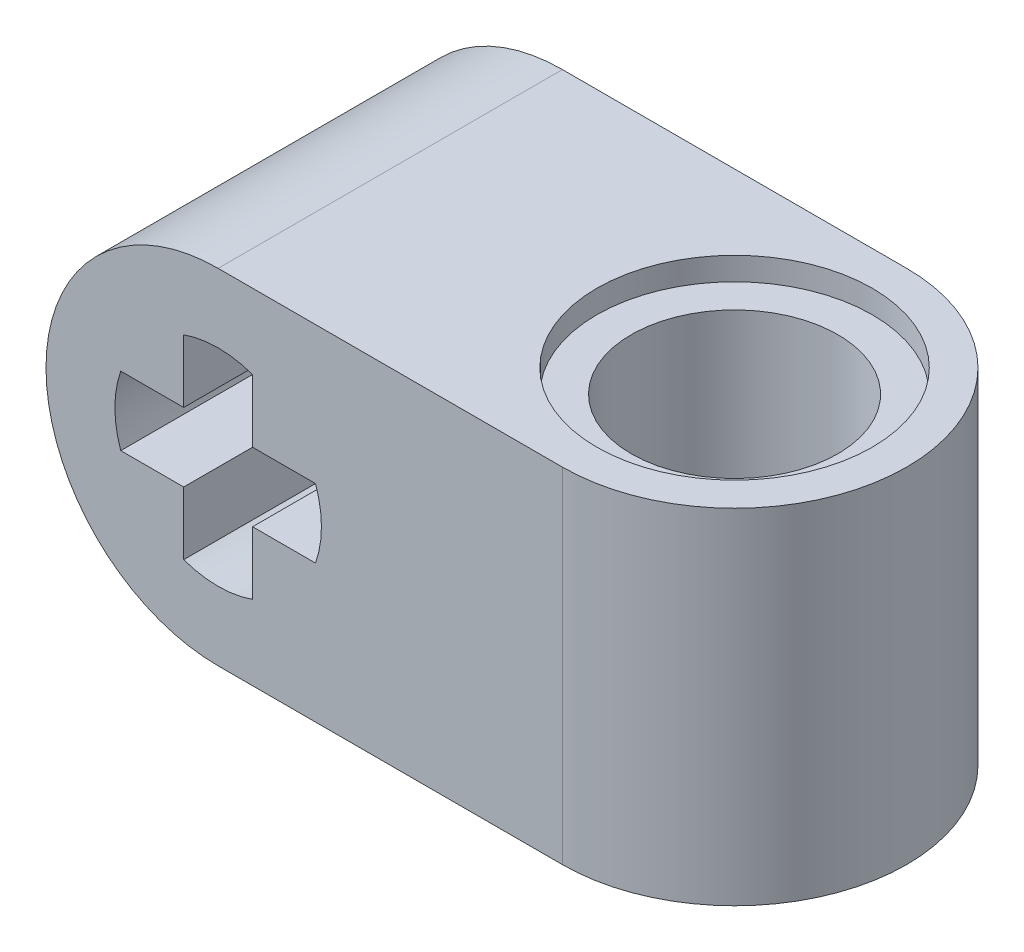
ISO-10303-21;
HEADER;
FILE_DESCRIPTION(('STEP AP214'),'2;1');
FILE_NAME('part.step','',(''),(''),'','','');
FILE_SCHEMA(('AUTOMOTIVE_DESIGN { 1 0 10303 214 1 1 1 1 }'));
ENDSEC;
DATA;
#1=APPLICATION_CONTEXT('core data for automotive mechanical design processes');
#2=APPLICATION_PROTOCOL_DEFINITION('international standard','automotive_design',2000,#1);
#3=PRODUCT_CONTEXT('',#1,'mechanical');
#4=PRODUCT('Part','Part','',(#3));
#5=PRODUCT_RELATED_PRODUCT_CATEGORY('part','',(#4));
#6=PRODUCT_DEFINITION_FORMATION('','',#4);
#7=PRODUCT_DEFINITION_CONTEXT('part definition',#1,'design');
#8=PRODUCT_DEFINITION('design','',#6,#7);
#9=PRODUCT_DEFINITION_SHAPE('','',#8);
#10=(LENGTH_UNIT() NAMED_UNIT(*) SI_UNIT(.MILLI.,.METRE.));
#11=(NAMED_UNIT(*) PLANE_ANGLE_UNIT() SI_UNIT($,.RADIAN.));
#12=(NAMED_UNIT(*) SI_UNIT($,.STERADIAN.) SOLID_ANGLE_UNIT());
#13=UNCERTAINTY_MEASURE_WITH_UNIT(LENGTH_MEASURE(1.E-05),#10,'distance_accuracy_value','');
#14=(GEOMETRIC_REPRESENTATION_CONTEXT(3) GLOBAL_UNCERTAINTY_ASSIGNED_CONTEXT((#13)) GLOBAL_UNIT_ASSIGNED_CONTEXT((#10,
#11,#12)) REPRESENTATION_CONTEXT('',''));
#15=CARTESIAN_POINT('',(0.,0.,0.));
#16=DIRECTION('',(0.,0.,1.));
#17=DIRECTION('',(1.,0.,0.));
#18=AXIS2_PLACEMENT_3D('',#15,#16,#17);
#19=CARTESIAN_POINT('',(0.,5.,2.5));
#20=DIRECTION('',(0.,0.,-1.));
#21=DIRECTION('',(-1.,0.,0.));
#22=AXIS2_PLACEMENT_3D('',#19,#20,#21);
#23=PLANE('',#22);
#24=DIRECTION('',(1.,0.,0.));
#25=VECTOR('',#24,1.);
#26=CARTESIAN_POINT('',(0.,3.,2.5));
#27=LINE('',#26,#25);
#28=CARTESIAN_POINT('',(-3.9142135623731,3.,2.5));
#29=VERTEX_POINT('',#28);
#30=CARTESIAN_POINT('',(-3.,3.,2.5));
#31=VERTEX_POINT('',#30);
#32=EDGE_CURVE('E157',#29,#31,#27,.T.);
#33=ORIENTED_EDGE('',*,*,#32,.T.);
#34=DIRECTION('',(0.,1.,0.));
#35=VECTOR('',#34,1.);
#36=CARTESIAN_POINT('',(-3.,0.,2.5));
#37=LINE('',#36,#35);
#38=CARTESIAN_POINT('',(-3.,3.91421356237309,2.5));
#39=VERTEX_POINT('',#38);
#40=EDGE_CURVE('E350',#31,#39,#37,.T.);
#41=ORIENTED_EDGE('',*,*,#40,.T.);
#42=CARTESIAN_POINT('',(-2.5,2.5,2.5));
#43=DIRECTION('',(0.,0.,1.));
#44=DIRECTION('',(1.,0.,0.));
#45=AXIS2_PLACEMENT_3D('',#42,#43,#44);
#46=CIRCLE('',#45,1.5);
#47=CARTESIAN_POINT('',(-2.,3.91421356237309,2.5));
#48=VERTEX_POINT('',#47);
#49=EDGE_CURVE('E354',#48,#39,#46,.T.);
#50=ORIENTED_EDGE('',*,*,#49,.F.);
#51=DIRECTION('',(0.,1.,0.));
#52=VECTOR('',#51,1.);
#53=CARTESIAN_POINT('',(-2.,0.,2.5));
#54=LINE('',#53,#52);
#55=CARTESIAN_POINT('',(-2.,3.,2.5));
#56=VERTEX_POINT('',#55);
#57=EDGE_CURVE('E377',#56,#48,#54,.T.);
#58=ORIENTED_EDGE('',*,*,#57,.F.);
#59=DIRECTION('',(1.,0.,0.));
#60=VECTOR('',#59,1.);
#61=CARTESIAN_POINT('',(0.,3.,2.5));
#62=LINE('',#61,#60);
#63=CARTESIAN_POINT('',(-1.08578643762691,3.,2.5));
#64=VERTEX_POINT('',#63);
#65=EDGE_CURVE('E339',#56,#64,#62,.T.);
#66=ORIENTED_EDGE('',*,*,#65,.T.);
#67=CARTESIAN_POINT('',(-2.5,2.5,2.5));
#68=DIRECTION('',(0.,0.,1.));
#69=DIRECTION('',(1.,0.,0.));
#70=AXIS2_PLACEMENT_3D('',#67,#68,#69);
#71=CIRCLE('',#70,1.5);
#72=CARTESIAN_POINT('',(-1.08578643762691,2.,2.5));
#73=VERTEX_POINT('',#72);
#74=EDGE_CURVE('E374',#73,#64,#71,.T.);
#75=ORIENTED_EDGE('',*,*,#74,.F.);
#76=DIRECTION('',(1.,0.,0.));
#77=VECTOR('',#76,1.);
#78=CARTESIAN_POINT('',(0.,2.,2.5));
#79=LINE('',#78,#77);
#80=CARTESIAN_POINT('',(-2.,2.,2.5));
#81=VERTEX_POINT('',#80);
#82=EDGE_CURVE('E371',#81,#73,#79,.T.);
#83=ORIENTED_EDGE('',*,*,#82,.F.);
#84=DIRECTION('',(0.,1.,0.));
#85=VECTOR('',#84,1.);
#86=CARTESIAN_POINT('',(-2.,0.,2.5));
#87=LINE('',#86,#85);
#88=CARTESIAN_POINT('',(-2.,1.08578643762691,2.5));
#89=VERTEX_POINT('',#88);
#90=EDGE_CURVE('E368',#89,#81,#87,.T.);
#91=ORIENTED_EDGE('',*,*,#90,.F.);
#92=CARTESIAN_POINT('',(-2.5,2.5,2.5));
#93=DIRECTION('',(0.,0.,1.));
#94=DIRECTION('',(1.,0.,0.));
#95=AXIS2_PLACEMENT_3D('',#92,#93,#94);
#96=CIRCLE('',#95,1.5);
#97=CARTESIAN_POINT('',(-3.,1.08578643762691,2.5));
#98=VERTEX_POINT('',#97);
#99=EDGE_CURVE('E362',#98,#89,#96,.T.);
#100=ORIENTED_EDGE('',*,*,#99,.F.);
#101=DIRECTION('',(0.,1.,0.));
#102=VECTOR('',#101,1.);
#103=CARTESIAN_POINT('',(-3.,0.,2.5));
#104=LINE('',#103,#102);
#105=CARTESIAN_POINT('',(-3.,2.,2.5));
#106=VERTEX_POINT('',#105);
#107=EDGE_CURVE('E320',#98,#106,#104,.T.);
#108=ORIENTED_EDGE('',*,*,#107,.T.);
#109=DIRECTION('',(1.,0.,0.));
#110=VECTOR('',#109,1.);
#111=CARTESIAN_POINT('',(0.,2.,2.5));
#112=LINE('',#111,#110);
#113=CARTESIAN_POINT('',(-3.9142135623731,2.,2.5));
#114=VERTEX_POINT('',#113);
#115=EDGE_CURVE('E359',#114,#106,#112,.T.);
#116=ORIENTED_EDGE('',*,*,#115,.F.);
#117=CARTESIAN_POINT('',(-2.5,2.5,2.5));
#118=DIRECTION('',(0.,0.,1.));
#119=DIRECTION('',(1.,0.,0.));
#120=AXIS2_PLACEMENT_3D('',#117,#118,#119);
#121=CIRCLE('',#120,1.5);
#122=EDGE_CURVE('E357',#29,#114,#121,.T.);
#123=ORIENTED_EDGE('',*,*,#122,.F.);
#124=EDGE_LOOP('',(#33,#41,#50,#58,#66,#75,#83,#91,#100,#108,#116,#123));
#125=FACE_BOUND('',#124,.T.);
#126=CARTESIAN_POINT('',(-2.5,2.5,2.5));
#127=DIRECTION('',(0.,0.,1.));
#128=DIRECTION('',(1.,0.,0.));
#129=AXIS2_PLACEMENT_3D('',#126,#127,#128);
#130=CIRCLE('',#129,2.5);
#131=CARTESIAN_POINT('',(-2.5,5.,2.5));
#132=VERTEX_POINT('',#131);
#133=CARTESIAN_POINT('',(-2.5,0.,2.5));
#134=VERTEX_POINT('',#133);
#135=EDGE_CURVE('E255',#132,#134,#130,.T.);
#136=ORIENTED_EDGE('',*,*,#135,.T.);
#137=DIRECTION('',(1.,0.,0.));
#138=VECTOR('',#137,1.);
#139=CARTESIAN_POINT('',(0.,0.,2.5));
#140=LINE('',#139,#138);
#141=CARTESIAN_POINT('',(2.5,0.,2.5));
#142=VERTEX_POINT('',#141);
#143=EDGE_CURVE('E259',#134,#142,#140,.T.);
#144=ORIENTED_EDGE('',*,*,#143,.T.);
#145=DIRECTION('',(0.,-1.,0.));
#146=VECTOR('',#145,1.);
#147=CARTESIAN_POINT('',(2.5,5.,2.5));
#148=LINE('',#147,#146);
#149=CARTESIAN_POINT('',(2.5,5.,2.5));
#150=VERTEX_POINT('',#149);
#151=EDGE_CURVE('E12',#150,#142,#148,.T.);
#152=ORIENTED_EDGE('',*,*,#151,.F.);
#153=DIRECTION('',(1.,0.,0.));
#154=VECTOR('',#153,1.);
#155=CARTESIAN_POINT('',(0.,5.,2.5));
#156=LINE('',#155,#154);
#157=EDGE_CURVE('E261',#132,#150,#156,.T.);
#158=ORIENTED_EDGE('',*,*,#157,.F.);
#159=EDGE_LOOP('',(#136,#144,#152,#158));
#160=FACE_BOUND('',#159,.T.);
#161=ADVANCED_FACE('F143',(#125,#160),#23,.F.);
#162=CARTESIAN_POINT('',(0.,5.,-2.5));
#163=DIRECTION('',(0.,0.,-1.));
#164=DIRECTION('',(-1.,0.,0.));
#165=AXIS2_PLACEMENT_3D('',#162,#163,#164);
#166=PLANE('',#165);
#167=DIRECTION('',(0.,1.,0.));
#168=VECTOR('',#167,1.);
#169=CARTESIAN_POINT('',(-3.,0.,-2.5));
#170=LINE('',#169,#168);
#171=CARTESIAN_POINT('',(-3.,3.,-2.5));
#172=VERTEX_POINT('',#171);
#173=CARTESIAN_POINT('',(-3.,3.91421356237309,-2.5));
#174=VERTEX_POINT('',#173);
#175=EDGE_CURVE('E341',#172,#174,#170,.T.);
#176=ORIENTED_EDGE('',*,*,#175,.F.);
#177=DIRECTION('',(1.,0.,0.));
#178=VECTOR('',#177,1.);
#179=CARTESIAN_POINT('',(0.,3.,-2.5));
#180=LINE('',#179,#178);
#181=CARTESIAN_POINT('',(-3.9142135623731,3.,-2.5));
#182=VERTEX_POINT('',#181);
#183=EDGE_CURVE('E352',#182,#172,#180,.T.);
#184=ORIENTED_EDGE('',*,*,#183,.F.);
#185=CARTESIAN_POINT('',(-2.5,2.5,-2.5));
#186=DIRECTION('',(0.,0.,-1.));
#187=DIRECTION('',(-1.,0.,0.));
#188=AXIS2_PLACEMENT_3D('',#185,#186,#187);
#189=CIRCLE('',#188,1.5);
#190=CARTESIAN_POINT('',(-3.9142135623731,2.,-2.5));
#191=VERTEX_POINT('',#190);
#192=EDGE_CURVE('E397',#182,#191,#189,.F.);
#193=ORIENTED_EDGE('',*,*,#192,.T.);
#194=DIRECTION('',(1.,0.,0.));
#195=VECTOR('',#194,1.);
#196=CARTESIAN_POINT('',(0.,2.,-2.5));
#197=LINE('',#196,#195);
#198=CARTESIAN_POINT('',(-3.,2.,-2.5));
#199=VERTEX_POINT('',#198);
#200=EDGE_CURVE('E316',#191,#199,#197,.T.);
#201=ORIENTED_EDGE('',*,*,#200,.T.);
#202=DIRECTION('',(0.,1.,0.));
#203=VECTOR('',#202,1.);
#204=CARTESIAN_POINT('',(-3.,0.,-2.5));
#205=LINE('',#204,#203);
#206=CARTESIAN_POINT('',(-3.,1.08578643762691,-2.5));
#207=VERTEX_POINT('',#206);
#208=EDGE_CURVE('E315',#207,#199,#205,.T.);
#209=ORIENTED_EDGE('',*,*,#208,.F.);
#210=CARTESIAN_POINT('',(-2.5,2.5,-2.5));
#211=DIRECTION('',(0.,0.,-1.));
#212=DIRECTION('',(-1.,0.,0.));
#213=AXIS2_PLACEMENT_3D('',#210,#211,#212);
#214=CIRCLE('',#213,1.5);
#215=CARTESIAN_POINT('',(-2.,1.08578643762691,-2.5));
#216=VERTEX_POINT('',#215);
#217=EDGE_CURVE('E323',#207,#216,#214,.F.);
#218=ORIENTED_EDGE('',*,*,#217,.T.);
#219=DIRECTION('',(0.,1.,0.));
#220=VECTOR('',#219,1.);
#221=CARTESIAN_POINT('',(-2.,0.,-2.5));
#222=LINE('',#221,#220);
#223=CARTESIAN_POINT('',(-2.,2.,-2.5));
#224=VERTEX_POINT('',#223);
#225=EDGE_CURVE('E328',#216,#224,#222,.T.);
#226=ORIENTED_EDGE('',*,*,#225,.T.);
#227=DIRECTION('',(1.,0.,0.));
#228=VECTOR('',#227,1.);
#229=CARTESIAN_POINT('',(0.,2.,-2.5));
#230=LINE('',#229,#228);
#231=CARTESIAN_POINT('',(-1.08578643762691,2.,-2.5));
#232=VERTEX_POINT('',#231);
#233=EDGE_CURVE('E332',#224,#232,#230,.T.);
#234=ORIENTED_EDGE('',*,*,#233,.T.);
#235=CARTESIAN_POINT('',(-2.5,2.5,-2.5));
#236=DIRECTION('',(0.,0.,-1.));
#237=DIRECTION('',(-1.,0.,0.));
#238=AXIS2_PLACEMENT_3D('',#235,#236,#237);
#239=CIRCLE('',#238,1.5);
#240=CARTESIAN_POINT('',(-1.08578643762691,3.,-2.5));
#241=VERTEX_POINT('',#240);
#242=EDGE_CURVE('E336',#232,#241,#239,.F.);
#243=ORIENTED_EDGE('',*,*,#242,.T.);
#244=DIRECTION('',(1.,0.,0.));
#245=VECTOR('',#244,1.);
#246=CARTESIAN_POINT('',(0.,3.,-2.5));
#247=LINE('',#246,#245);
#248=CARTESIAN_POINT('',(-2.,3.,-2.5));
#249=VERTEX_POINT('',#248);
#250=EDGE_CURVE('E322',#249,#241,#247,.T.);
#251=ORIENTED_EDGE('',*,*,#250,.F.);
#252=DIRECTION('',(0.,1.,0.));
#253=VECTOR('',#252,1.);
#254=CARTESIAN_POINT('',(-2.,0.,-2.5));
#255=LINE('',#254,#253);
#256=CARTESIAN_POINT('',(-2.,3.91421356237309,-2.5));
#257=VERTEX_POINT('',#256);
#258=EDGE_CURVE('E342',#249,#257,#255,.T.);
#259=ORIENTED_EDGE('',*,*,#258,.T.);
#260=CARTESIAN_POINT('',(-2.5,2.5,-2.5));
#261=DIRECTION('',(0.,0.,-1.));
#262=DIRECTION('',(-1.,0.,0.));
#263=AXIS2_PLACEMENT_3D('',#260,#261,#262);
#264=CIRCLE('',#263,1.5);
#265=EDGE_CURVE('E347',#257,#174,#264,.F.);
#266=ORIENTED_EDGE('',*,*,#265,.T.);
#267=EDGE_LOOP('',(#176,#184,#193,#201,#209,#218,#226,#234,#243,#251,#259,#266));
#268=FACE_BOUND('',#267,.T.);
#269=DIRECTION('',(1.,0.,0.));
#270=VECTOR('',#269,1.);
#271=CARTESIAN_POINT('',(0.,0.,-2.5));
#272=LINE('',#271,#270);
#273=CARTESIAN_POINT('',(-2.5,0.,-2.5));
#274=VERTEX_POINT('',#273);
#275=CARTESIAN_POINT('',(2.5,0.,-2.5));
#276=VERTEX_POINT('',#275);
#277=EDGE_CURVE('E280',#274,#276,#272,.T.);
#278=ORIENTED_EDGE('',*,*,#277,.F.);
#279=CARTESIAN_POINT('',(-2.5,2.5,-2.5));
#280=DIRECTION('',(0.,0.,-1.));
#281=DIRECTION('',(-1.,0.,0.));
#282=AXIS2_PLACEMENT_3D('',#279,#280,#281);
#283=CIRCLE('',#282,2.5);
#284=CARTESIAN_POINT('',(-2.5,5.,-2.5));
#285=VERTEX_POINT('',#284);
#286=EDGE_CURVE('E265',#285,#274,#283,.F.);
#287=ORIENTED_EDGE('',*,*,#286,.F.);
#288=DIRECTION('',(1.,0.,0.));
#289=VECTOR('',#288,1.);
#290=CARTESIAN_POINT('',(0.,5.,-2.5));
#291=LINE('',#290,#289);
#292=CARTESIAN_POINT('',(2.5,5.,-2.5));
#293=VERTEX_POINT('',#292);
#294=EDGE_CURVE('E286',#285,#293,#291,.T.);
#295=ORIENTED_EDGE('',*,*,#294,.T.);
#296=DIRECTION('',(0.,-1.,0.));
#297=VECTOR('',#296,1.);
#298=CARTESIAN_POINT('',(2.5,5.,-2.5));
#299=LINE('',#298,#297);
#300=EDGE_CURVE('E150',#293,#276,#299,.T.);
#301=ORIENTED_EDGE('',*,*,#300,.T.);
#302=EDGE_LOOP('',(#278,#287,#295,#301));
#303=FACE_BOUND('',#302,.T.);
#304=ADVANCED_FACE('F404',(#268,#303),#166,.T.);
#305=CARTESIAN_POINT('',(0.,0.,0.));
#306=DIRECTION('',(0.,1.,0.));
#307=DIRECTION('',(0.,0.,1.));
#308=AXIS2_PLACEMENT_3D('',#305,#306,#307);
#309=PLANE('',#308);
#310=CARTESIAN_POINT('',(2.5,0.,0.));
#311=DIRECTION('',(0.,1.,0.));
#312=DIRECTION('',(0.,0.,1.));
#313=AXIS2_PLACEMENT_3D('',#310,#311,#312);
#314=CIRCLE('',#313,2.);
#315=CARTESIAN_POINT('',(2.5,0.,2.));
#316=VERTEX_POINT('',#315);
#317=EDGE_CURVE('E299',#316,#316,#314,.T.);
#318=ORIENTED_EDGE('',*,*,#317,.T.);
#319=EDGE_LOOP('',(#318));
#320=FACE_BOUND('',#319,.T.);
#321=DIRECTION('',(0.,0.,1.));
#322=VECTOR('',#321,1.);
#323=CARTESIAN_POINT('',(-2.5,0.,-2.501));
#324=LINE('',#323,#322);
#325=EDGE_CURVE('E268',#274,#134,#324,.T.);
#326=ORIENTED_EDGE('',*,*,#325,.F.);
#327=ORIENTED_EDGE('',*,*,#277,.T.);
#328=CARTESIAN_POINT('',(2.5,0.,0.));
#329=DIRECTION('',(0.,1.,0.));
#330=DIRECTION('',(0.,0.,1.));
#331=AXIS2_PLACEMENT_3D('',#328,#329,#330);
#332=CIRCLE('',#331,2.5);
#333=EDGE_CURVE('E277',#142,#276,#332,.T.);
#334=ORIENTED_EDGE('',*,*,#333,.F.);
#335=ORIENTED_EDGE('',*,*,#143,.F.);
#336=EDGE_LOOP('',(#326,#327,#334,#335));
#337=FACE_BOUND('',#336,.T.);
#338=ADVANCED_FACE('F275',(#320,#337),#309,.F.);
#339=CARTESIAN_POINT('',(0.,5.,0.));
#340=DIRECTION('',(0.,1.,0.));
#341=DIRECTION('',(0.,0.,1.));
#342=AXIS2_PLACEMENT_3D('',#339,#340,#341);
#343=PLANE('',#342);
#344=CARTESIAN_POINT('',(2.5,5.,0.));
#345=DIRECTION('',(0.,1.,0.));
#346=DIRECTION('',(0.,0.,1.));
#347=AXIS2_PLACEMENT_3D('',#344,#345,#346);
#348=CIRCLE('',#347,2.);
#349=CARTESIAN_POINT('',(2.5,5.,2.));
#350=VERTEX_POINT('',#349);
#351=EDGE_CURVE('E305',#350,#350,#348,.T.);
#352=ORIENTED_EDGE('',*,*,#351,.F.);
#353=EDGE_LOOP('',(#352));
#354=FACE_BOUND('',#353,.T.);
#355=ORIENTED_EDGE('',*,*,#294,.F.);
#356=DIRECTION('',(0.,0.,1.));
#357=VECTOR('',#356,1.);
#358=CARTESIAN_POINT('',(-2.5,5.,-2.501));
#359=LINE('',#358,#357);
#360=EDGE_CURVE('E264',#285,#132,#359,.T.);
#361=ORIENTED_EDGE('',*,*,#360,.T.);
#362=ORIENTED_EDGE('',*,*,#157,.T.);
#363=CARTESIAN_POINT('',(2.5,5.,0.));
#364=DIRECTION('',(0.,1.,0.));
#365=DIRECTION('',(0.,0.,1.));
#366=AXIS2_PLACEMENT_3D('',#363,#364,#365);
#367=CIRCLE('',#366,2.5);
#368=EDGE_CURVE('E292',#150,#293,#367,.T.);
#369=ORIENTED_EDGE('',*,*,#368,.T.);
#370=EDGE_LOOP('',(#355,#361,#362,#369));
#371=FACE_BOUND('',#370,.T.);
#372=ADVANCED_FACE('F467',(#354,#371),#343,.T.);
#373=CARTESIAN_POINT('',(2.5,5.,0.));
#374=DIRECTION('',(0.,-1.,0.));
#375=DIRECTION('',(0.,0.,-1.));
#376=AXIS2_PLACEMENT_3D('',#373,#374,#375);
#377=CYLINDRICAL_SURFACE('',#376,1.5);
#378=CARTESIAN_POINT('',(2.5,0.333333333333333,0.));
#379=DIRECTION('',(0.,1.,0.));
#380=DIRECTION('',(0.,0.,1.));
#381=AXIS2_PLACEMENT_3D('',#378,#379,#380);
#382=CIRCLE('',#381,1.5);
#383=CARTESIAN_POINT('',(2.5,0.333333333333333,1.5));
#384=VERTEX_POINT('',#383);
#385=EDGE_CURVE('E283',#384,#384,#382,.T.);
#386=ORIENTED_EDGE('',*,*,#385,.F.);
#387=EDGE_LOOP('',(#386));
#388=FACE_BOUND('',#387,.T.);
#389=CARTESIAN_POINT('',(2.5,4.66666666666667,0.));
#390=DIRECTION('',(0.,1.,0.));
#391=DIRECTION('',(0.,0.,1.));
#392=AXIS2_PLACEMENT_3D('',#389,#390,#391);
#393=CIRCLE('',#392,1.49999999999996);
#394=CARTESIAN_POINT('',(2.5,4.66666666666667,1.49999999999996));
#395=VERTEX_POINT('',#394);
#396=EDGE_CURVE('E308',#395,#395,#393,.T.);
#397=ORIENTED_EDGE('',*,*,#396,.T.);
#398=EDGE_LOOP('',(#397));
#399=FACE_BOUND('',#398,.T.);
#400=ADVANCED_FACE('F471',(#388,#399),#377,.F.);
#401=CARTESIAN_POINT('',(2.5,5.,0.));
#402=DIRECTION('',(0.,-1.,0.));
#403=DIRECTION('',(0.,0.,-1.));
#404=AXIS2_PLACEMENT_3D('',#401,#402,#403);
#405=CYLINDRICAL_SURFACE('',#404,2.5);
#406=ORIENTED_EDGE('',*,*,#333,.T.);
#407=ORIENTED_EDGE('',*,*,#300,.F.);
#408=ORIENTED_EDGE('',*,*,#368,.F.);
#409=ORIENTED_EDGE('',*,*,#151,.T.);
#410=EDGE_LOOP('',(#406,#407,#408,#409));
#411=FACE_BOUND('',#410,.T.);
#412=ADVANCED_FACE('F472',(#411),#405,.T.);
#413=CARTESIAN_POINT('',(2.5,0.333333333333333,0.));
#414=DIRECTION('',(0.,-1.,0.));
#415=DIRECTION('',(0.,0.,-1.));
#416=AXIS2_PLACEMENT_3D('',#413,#414,#415);
#417=CYLINDRICAL_SURFACE('',#416,2.);
#418=CARTESIAN_POINT('',(2.5,0.333333333333333,0.));
#419=DIRECTION('',(0.,1.,0.));
#420=DIRECTION('',(0.,0.,1.));
#421=AXIS2_PLACEMENT_3D('',#418,#419,#420);
#422=CIRCLE('',#421,2.);
#423=CARTESIAN_POINT('',(2.5,0.333333333333333,2.));
#424=VERTEX_POINT('',#423);
#425=EDGE_CURVE('E278',#424,#424,#422,.T.);
#426=ORIENTED_EDGE('',*,*,#425,.T.);
#427=EDGE_LOOP('',(#426));
#428=FACE_BOUND('',#427,.T.);
#429=ORIENTED_EDGE('',*,*,#317,.F.);
#430=EDGE_LOOP('',(#429));
#431=FACE_BOUND('',#430,.T.);
#432=ADVANCED_FACE('F474',(#428,#431),#417,.F.);
#433=CARTESIAN_POINT('',(0.,0.333333333333333,0.));
#434=DIRECTION('',(0.,1.,0.));
#435=DIRECTION('',(0.,0.,1.));
#436=AXIS2_PLACEMENT_3D('',#433,#434,#435);
#437=PLANE('',#436);
#438=ORIENTED_EDGE('',*,*,#385,.T.);
#439=EDGE_LOOP('',(#438));
#440=FACE_BOUND('',#439,.T.);
#441=ORIENTED_EDGE('',*,*,#425,.F.);
#442=EDGE_LOOP('',(#441));
#443=FACE_BOUND('',#442,.T.);
#444=ADVANCED_FACE('F480',(#440,#443),#437,.F.);
#445=CARTESIAN_POINT('',(2.5,4.66666666666667,0.));
#446=DIRECTION('',(0.,1.,0.));
#447=DIRECTION('',(0.,0.,1.));
#448=AXIS2_PLACEMENT_3D('',#445,#446,#447);
#449=CYLINDRICAL_SURFACE('',#448,2.);
#450=CARTESIAN_POINT('',(2.5,4.66666666666667,0.));
#451=DIRECTION('',(0.,1.,0.));
#452=DIRECTION('',(0.,0.,1.));
#453=AXIS2_PLACEMENT_3D('',#450,#451,#452);
#454=CIRCLE('',#453,2.);
#455=CARTESIAN_POINT('',(2.5,4.66666666666667,2.));
#456=VERTEX_POINT('',#455);
#457=EDGE_CURVE('E301',#456,#456,#454,.T.);
#458=ORIENTED_EDGE('',*,*,#457,.F.);
#459=EDGE_LOOP('',(#458));
#460=FACE_BOUND('',#459,.T.);
#461=ORIENTED_EDGE('',*,*,#351,.T.);
#462=EDGE_LOOP('',(#461));
#463=FACE_BOUND('',#462,.T.);
#464=ADVANCED_FACE('F496',(#460,#463),#449,.F.);
#465=CARTESIAN_POINT('',(2.5,4.66666666666667,0.));
#466=DIRECTION('',(0.,1.,0.));
#467=DIRECTION('',(0.,0.,1.));
#468=AXIS2_PLACEMENT_3D('',#465,#466,#467);
#469=PLANE('',#468);
#470=ORIENTED_EDGE('',*,*,#396,.F.);
#471=EDGE_LOOP('',(#470));
#472=FACE_BOUND('',#471,.T.);
#473=ORIENTED_EDGE('',*,*,#457,.T.);
#474=EDGE_LOOP('',(#473));
#475=FACE_BOUND('',#474,.T.);
#476=ADVANCED_FACE('F493',(#472,#475),#469,.T.);
#477=CARTESIAN_POINT('',(-2.5,2.5,-2.501));
#478=DIRECTION('',(0.,0.,1.));
#479=DIRECTION('',(1.,0.,0.));
#480=AXIS2_PLACEMENT_3D('',#477,#478,#479);
#481=CYLINDRICAL_SURFACE('',#480,2.5);
#482=ORIENTED_EDGE('',*,*,#286,.T.);
#483=ORIENTED_EDGE('',*,*,#325,.T.);
#484=ORIENTED_EDGE('',*,*,#135,.F.);
#485=ORIENTED_EDGE('',*,*,#360,.F.);
#486=EDGE_LOOP('',(#482,#483,#484,#485));
#487=FACE_BOUND('',#486,.T.);
#488=ADVANCED_FACE('F269',(#487),#481,.T.);
#489=CARTESIAN_POINT('',(0.,3.,-2.501));
#490=DIRECTION('',(0.,-1.,0.));
#491=DIRECTION('',(0.,0.,-1.));
#492=AXIS2_PLACEMENT_3D('',#489,#490,#491);
#493=PLANE('',#492);
#494=ORIENTED_EDGE('',*,*,#183,.T.);
#495=DIRECTION('',(0.,0.,1.));
#496=VECTOR('',#495,1.);
#497=CARTESIAN_POINT('',(-3.,3.,-2.501));
#498=LINE('',#497,#496);
#499=EDGE_CURVE('E356',#172,#31,#498,.T.);
#500=ORIENTED_EDGE('',*,*,#499,.T.);
#501=ORIENTED_EDGE('',*,*,#32,.F.);
#502=DIRECTION('',(0.,0.,1.));
#503=VECTOR('',#502,1.);
#504=CARTESIAN_POINT('',(-3.9142135623731,3.,-2.501));
#505=LINE('',#504,#503);
#506=EDGE_CURVE('E273',#182,#29,#505,.T.);
#507=ORIENTED_EDGE('',*,*,#506,.F.);
#508=EDGE_LOOP('',(#494,#500,#501,#507));
#509=FACE_BOUND('',#508,.T.);
#510=ADVANCED_FACE('F408',(#509),#493,.T.);
#511=CARTESIAN_POINT('',(-3.,0.,-2.501));
#512=DIRECTION('',(1.,0.,0.));
#513=DIRECTION('',(0.,0.,-1.));
#514=AXIS2_PLACEMENT_3D('',#511,#512,#513);
#515=PLANE('',#514);
#516=ORIENTED_EDGE('',*,*,#175,.T.);
#517=DIRECTION('',(0.,0.,1.));
#518=VECTOR('',#517,1.);
#519=CARTESIAN_POINT('',(-3.,3.91421356237309,-2.501));
#520=LINE('',#519,#518);
#521=EDGE_CURVE('E346',#174,#39,#520,.T.);
#522=ORIENTED_EDGE('',*,*,#521,.T.);
#523=ORIENTED_EDGE('',*,*,#40,.F.);
#524=ORIENTED_EDGE('',*,*,#499,.F.);
#525=EDGE_LOOP('',(#516,#522,#523,#524));
#526=FACE_BOUND('',#525,.T.);
#527=ADVANCED_FACE('F412',(#526),#515,.T.);
#528=CARTESIAN_POINT('',(-2.5,2.5,-2.501));
#529=DIRECTION('',(0.,0.,1.));
#530=DIRECTION('',(1.,0.,0.));
#531=AXIS2_PLACEMENT_3D('',#528,#529,#530);
#532=CYLINDRICAL_SURFACE('',#531,1.5);
#533=DIRECTION('',(0.,0.,1.));
#534=VECTOR('',#533,1.);
#535=CARTESIAN_POINT('',(-2.,3.91421356237309,-2.501));
#536=LINE('',#535,#534);
#537=EDGE_CURVE('E345',#257,#48,#536,.T.);
#538=ORIENTED_EDGE('',*,*,#537,.T.);
#539=ORIENTED_EDGE('',*,*,#49,.T.);
#540=ORIENTED_EDGE('',*,*,#521,.F.);
#541=ORIENTED_EDGE('',*,*,#265,.F.);
#542=EDGE_LOOP('',(#538,#539,#540,#541));
#543=FACE_BOUND('',#542,.T.);
#544=ADVANCED_FACE('F417',(#543),#532,.F.);
#545=CARTESIAN_POINT('',(-2.,0.,-2.501));
#546=DIRECTION('',(1.,0.,0.));
#547=DIRECTION('',(0.,0.,-1.));
#548=AXIS2_PLACEMENT_3D('',#545,#546,#547);
#549=PLANE('',#548);
#550=DIRECTION('',(0.,0.,1.));
#551=VECTOR('',#550,1.);
#552=CARTESIAN_POINT('',(-2.,3.,-2.501));
#553=LINE('',#552,#551);
#554=EDGE_CURVE('E380',#249,#56,#553,.T.);
#555=ORIENTED_EDGE('',*,*,#554,.T.);
#556=ORIENTED_EDGE('',*,*,#57,.T.);
#557=ORIENTED_EDGE('',*,*,#537,.F.);
#558=ORIENTED_EDGE('',*,*,#258,.F.);
#559=EDGE_LOOP('',(#555,#556,#557,#558));
#560=FACE_BOUND('',#559,.T.);
#561=ADVANCED_FACE('F419',(#560),#549,.F.);
#562=CARTESIAN_POINT('',(0.,3.,-2.501));
#563=DIRECTION('',(0.,-1.,0.));
#564=DIRECTION('',(0.,0.,-1.));
#565=AXIS2_PLACEMENT_3D('',#562,#563,#564);
#566=PLANE('',#565);
#567=ORIENTED_EDGE('',*,*,#250,.T.);
#568=DIRECTION('',(0.,0.,1.));
#569=VECTOR('',#568,1.);
#570=CARTESIAN_POINT('',(-1.08578643762691,3.,-2.501));
#571=LINE('',#570,#569);
#572=EDGE_CURVE('E335',#241,#64,#571,.T.);
#573=ORIENTED_EDGE('',*,*,#572,.T.);
#574=ORIENTED_EDGE('',*,*,#65,.F.);
#575=ORIENTED_EDGE('',*,*,#554,.F.);
#576=EDGE_LOOP('',(#567,#573,#574,#575));
#577=FACE_BOUND('',#576,.T.);
#578=ADVANCED_FACE('F450',(#577),#566,.T.);
#579=CARTESIAN_POINT('',(-2.5,2.5,-2.501));
#580=DIRECTION('',(0.,0.,1.));
#581=DIRECTION('',(1.,0.,0.));
#582=AXIS2_PLACEMENT_3D('',#579,#580,#581);
#583=CYLINDRICAL_SURFACE('',#582,1.5);
#584=DIRECTION('',(0.,0.,1.));
#585=VECTOR('',#584,1.);
#586=CARTESIAN_POINT('',(-1.08578643762691,2.,-2.501));
#587=LINE('',#586,#585);
#588=EDGE_CURVE('E331',#232,#73,#587,.T.);
#589=ORIENTED_EDGE('',*,*,#588,.T.);
#590=ORIENTED_EDGE('',*,*,#74,.T.);
#591=ORIENTED_EDGE('',*,*,#572,.F.);
#592=ORIENTED_EDGE('',*,*,#242,.F.);
#593=EDGE_LOOP('',(#589,#590,#591,#592));
#594=FACE_BOUND('',#593,.T.);
#595=ADVANCED_FACE('F448',(#594),#583,.F.);
#596=CARTESIAN_POINT('',(0.,2.,-2.501));
#597=DIRECTION('',(0.,-1.,0.));
#598=DIRECTION('',(0.,0.,-1.));
#599=AXIS2_PLACEMENT_3D('',#596,#597,#598);
#600=PLANE('',#599);
#601=DIRECTION('',(0.,0.,1.));
#602=VECTOR('',#601,1.);
#603=CARTESIAN_POINT('',(-2.,2.,-2.501));
#604=LINE('',#603,#602);
#605=EDGE_CURVE('E327',#224,#81,#604,.T.);
#606=ORIENTED_EDGE('',*,*,#605,.T.);
#607=ORIENTED_EDGE('',*,*,#82,.T.);
#608=ORIENTED_EDGE('',*,*,#588,.F.);
#609=ORIENTED_EDGE('',*,*,#233,.F.);
#610=EDGE_LOOP('',(#606,#607,#608,#609));
#611=FACE_BOUND('',#610,.T.);
#612=ADVANCED_FACE('F443',(#611),#600,.F.);
#613=CARTESIAN_POINT('',(-2.,0.,-2.501));
#614=DIRECTION('',(1.,0.,0.));
#615=DIRECTION('',(0.,0.,-1.));
#616=AXIS2_PLACEMENT_3D('',#613,#614,#615);
#617=PLANE('',#616);
#618=DIRECTION('',(0.,0.,1.));
#619=VECTOR('',#618,1.);
#620=CARTESIAN_POINT('',(-2.,1.08578643762691,-2.501));
#621=LINE('',#620,#619);
#622=EDGE_CURVE('E326',#216,#89,#621,.T.);
#623=ORIENTED_EDGE('',*,*,#622,.T.);
#624=ORIENTED_EDGE('',*,*,#90,.T.);
#625=ORIENTED_EDGE('',*,*,#605,.F.);
#626=ORIENTED_EDGE('',*,*,#225,.F.);
#627=EDGE_LOOP('',(#623,#624,#625,#626));
#628=FACE_BOUND('',#627,.T.);
#629=ADVANCED_FACE('F439',(#628),#617,.F.);
#630=CARTESIAN_POINT('',(-2.5,2.5,-2.501));
#631=DIRECTION('',(0.,0.,1.));
#632=DIRECTION('',(1.,0.,0.));
#633=AXIS2_PLACEMENT_3D('',#630,#631,#632);
#634=CYLINDRICAL_SURFACE('',#633,1.5);
#635=DIRECTION('',(0.,0.,1.));
#636=VECTOR('',#635,1.);
#637=CARTESIAN_POINT('',(-3.,1.08578643762691,-2.501));
#638=LINE('',#637,#636);
#639=EDGE_CURVE('E365',#207,#98,#638,.T.);
#640=ORIENTED_EDGE('',*,*,#639,.T.);
#641=ORIENTED_EDGE('',*,*,#99,.T.);
#642=ORIENTED_EDGE('',*,*,#622,.F.);
#643=ORIENTED_EDGE('',*,*,#217,.F.);
#644=EDGE_LOOP('',(#640,#641,#642,#643));
#645=FACE_BOUND('',#644,.T.);
#646=ADVANCED_FACE('F436',(#645),#634,.F.);
#647=CARTESIAN_POINT('',(-3.,0.,-2.501));
#648=DIRECTION('',(1.,0.,0.));
#649=DIRECTION('',(0.,0.,-1.));
#650=AXIS2_PLACEMENT_3D('',#647,#648,#649);
#651=PLANE('',#650);
#652=ORIENTED_EDGE('',*,*,#208,.T.);
#653=DIRECTION('',(0.,0.,1.));
#654=VECTOR('',#653,1.);
#655=CARTESIAN_POINT('',(-3.,2.,-2.501));
#656=LINE('',#655,#654);
#657=EDGE_CURVE('E319',#199,#106,#656,.T.);
#658=ORIENTED_EDGE('',*,*,#657,.T.);
#659=ORIENTED_EDGE('',*,*,#107,.F.);
#660=ORIENTED_EDGE('',*,*,#639,.F.);
#661=EDGE_LOOP('',(#652,#658,#659,#660));
#662=FACE_BOUND('',#661,.T.);
#663=ADVANCED_FACE('F432',(#662),#651,.T.);
#664=CARTESIAN_POINT('',(0.,2.,-2.501));
#665=DIRECTION('',(0.,-1.,0.));
#666=DIRECTION('',(0.,0.,-1.));
#667=AXIS2_PLACEMENT_3D('',#664,#665,#666);
#668=PLANE('',#667);
#669=DIRECTION('',(0.,0.,1.));
#670=VECTOR('',#669,1.);
#671=CARTESIAN_POINT('',(-3.9142135623731,2.,-2.501));
#672=LINE('',#671,#670);
#673=EDGE_CURVE('E165',#191,#114,#672,.T.);
#674=ORIENTED_EDGE('',*,*,#673,.T.);
#675=ORIENTED_EDGE('',*,*,#115,.T.);
#676=ORIENTED_EDGE('',*,*,#657,.F.);
#677=ORIENTED_EDGE('',*,*,#200,.F.);
#678=EDGE_LOOP('',(#674,#675,#676,#677));
#679=FACE_BOUND('',#678,.T.);
#680=ADVANCED_FACE('F430',(#679),#668,.F.);
#681=CARTESIAN_POINT('',(-2.5,2.5,-2.501));
#682=DIRECTION('',(0.,0.,1.));
#683=DIRECTION('',(1.,0.,0.));
#684=AXIS2_PLACEMENT_3D('',#681,#682,#683);
#685=CYLINDRICAL_SURFACE('',#684,1.5);
#686=ORIENTED_EDGE('',*,*,#506,.T.);
#687=ORIENTED_EDGE('',*,*,#122,.T.);
#688=ORIENTED_EDGE('',*,*,#673,.F.);
#689=ORIENTED_EDGE('',*,*,#192,.F.);
#690=EDGE_LOOP('',(#686,#687,#688,#689));
#691=FACE_BOUND('',#690,.T.);
#692=ADVANCED_FACE('F406',(#691),#685,.F.);
#693=CLOSED_SHELL('',(#161,#304,#338,#372,#400,#412,#432,#444,#464,#476,#488,#510,#527,#544,
#561,#578,#595,#612,#629,#646,#663,#680,#692));
#694=MANIFOLD_SOLID_BREP('B2',#693);
#695=ADVANCED_BREP_SHAPE_REPRESENTATION('',(#18,#694),#14);
#696=SHAPE_DEFINITION_REPRESENTATION(#9,#695);
ENDSEC;
END-ISO-10303-21;
